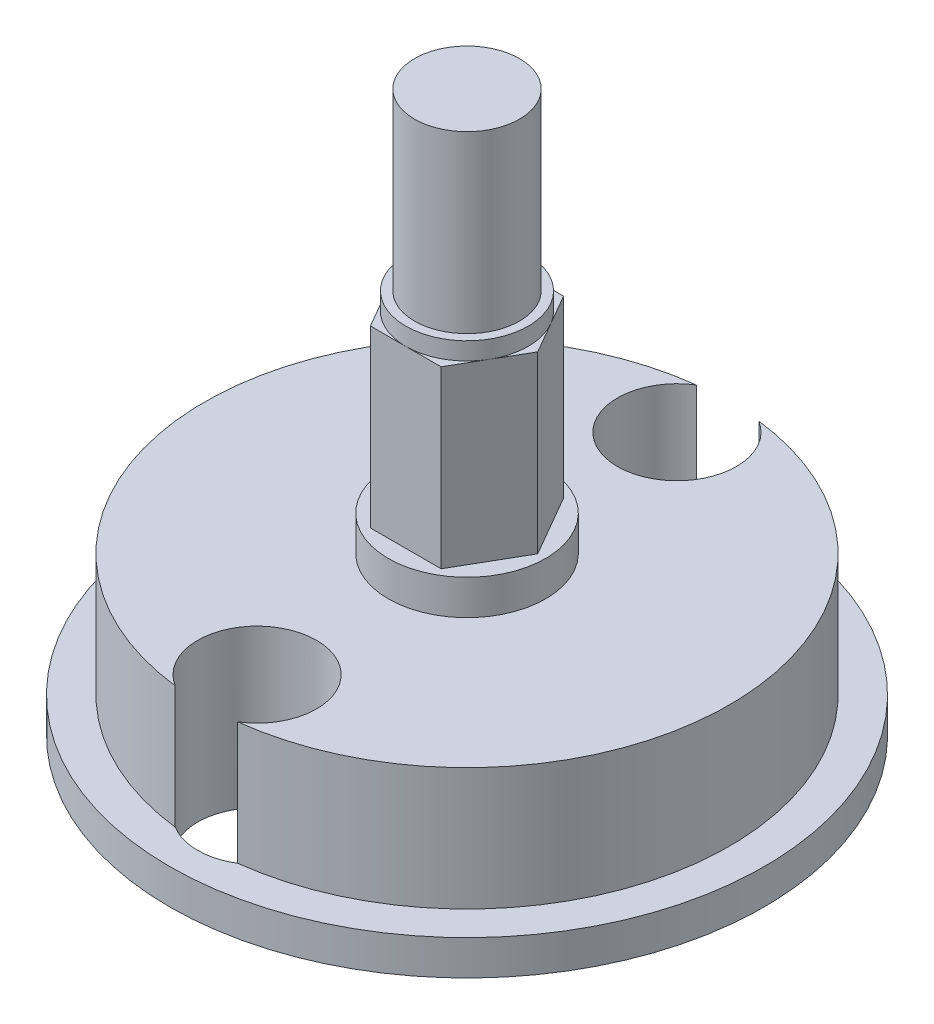
ISO-10303-21;
HEADER;
FILE_DESCRIPTION(('STEP AP214'),'2;1');
FILE_NAME('part.step','',(''),(''),'','','');
FILE_SCHEMA(('AUTOMOTIVE_DESIGN { 1 0 10303 214 1 1 1 1 }'));
ENDSEC;
DATA;
#1=APPLICATION_CONTEXT('core data for automotive mechanical design processes');
#2=APPLICATION_PROTOCOL_DEFINITION('international standard','automotive_design',2000,#1);
#3=PRODUCT_CONTEXT('',#1,'mechanical');
#4=PRODUCT('Part','Part','',(#3));
#5=PRODUCT_RELATED_PRODUCT_CATEGORY('part','',(#4));
#6=PRODUCT_DEFINITION_FORMATION('','',#4);
#7=PRODUCT_DEFINITION_CONTEXT('part definition',#1,'design');
#8=PRODUCT_DEFINITION('design','',#6,#7);
#9=PRODUCT_DEFINITION_SHAPE('','',#8);
#10=(LENGTH_UNIT() NAMED_UNIT(*) SI_UNIT(.MILLI.,.METRE.));
#11=(NAMED_UNIT(*) PLANE_ANGLE_UNIT() SI_UNIT($,.RADIAN.));
#12=(NAMED_UNIT(*) SI_UNIT($,.STERADIAN.) SOLID_ANGLE_UNIT());
#13=UNCERTAINTY_MEASURE_WITH_UNIT(LENGTH_MEASURE(1.E-05),#10,'distance_accuracy_value','');
#14=(GEOMETRIC_REPRESENTATION_CONTEXT(3) GLOBAL_UNCERTAINTY_ASSIGNED_CONTEXT((#13)) GLOBAL_UNIT_ASSIGNED_CONTEXT((#10,
#11,#12)) REPRESENTATION_CONTEXT('',''));
#15=CARTESIAN_POINT('',(0.,0.,0.));
#16=DIRECTION('',(0.,0.,1.));
#17=DIRECTION('',(1.,0.,0.));
#18=AXIS2_PLACEMENT_3D('',#15,#16,#17);
#19=CARTESIAN_POINT('',(0.,4.5,0.));
#20=DIRECTION('',(0.,-1.,0.));
#21=DIRECTION('',(0.,0.,-1.));
#22=AXIS2_PLACEMENT_3D('',#19,#20,#21);
#23=CYLINDRICAL_SURFACE('',#22,7.5);
#24=CARTESIAN_POINT('',(0.,1.,0.));
#25=DIRECTION('',(0.,1.,0.));
#26=DIRECTION('',(0.,0.,1.));
#27=AXIS2_PLACEMENT_3D('',#24,#25,#26);
#28=CIRCLE('',#27,7.5);
#29=CARTESIAN_POINT('',(0.892835682281763,0.999999999999999,-7.44666666666667));
#30=VERTEX_POINT('',#29);
#31=CARTESIAN_POINT('',(0.892835682281763,0.999999999999999,7.44666666666667));
#32=VERTEX_POINT('',#31);
#33=EDGE_CURVE('E141',#30,#32,#28,.F.);
#34=ORIENTED_EDGE('',*,*,#33,.F.);
#35=DIRECTION('',(0.,1.,0.));
#36=VECTOR('',#35,1.);
#37=CARTESIAN_POINT('',(0.892835682281764,2.25,-7.44666666666667));
#38=LINE('',#37,#36);
#39=CARTESIAN_POINT('',(0.892835682281764,4.5,-7.44666666666667));
#40=VERTEX_POINT('',#39);
#41=EDGE_CURVE('E132',#30,#40,#38,.T.);
#42=ORIENTED_EDGE('',*,*,#41,.T.);
#43=CARTESIAN_POINT('',(0.,4.5,0.));
#44=DIRECTION('',(0.,1.,0.));
#45=DIRECTION('',(0.,0.,1.));
#46=AXIS2_PLACEMENT_3D('',#43,#44,#45);
#47=CIRCLE('',#46,7.5);
#48=CARTESIAN_POINT('',(0.892835682281763,4.5,7.44666666666667));
#49=VERTEX_POINT('',#48);
#50=EDGE_CURVE('E140',#49,#40,#47,.T.);
#51=ORIENTED_EDGE('',*,*,#50,.F.);
#52=DIRECTION('',(0.,1.,0.));
#53=VECTOR('',#52,1.);
#54=CARTESIAN_POINT('',(0.892835682281764,2.25,7.44666666666667));
#55=LINE('',#54,#53);
#56=EDGE_CURVE('E59',#49,#32,#55,.F.);
#57=ORIENTED_EDGE('',*,*,#56,.T.);
#58=EDGE_LOOP('',(#34,#42,#51,#57));
#59=FACE_BOUND('',#58,.T.);
#60=ADVANCED_FACE('F37',(#59),#23,.T.);
#61=CARTESIAN_POINT('',(0.,10.5,0.));
#62=DIRECTION('',(0.,1.,0.));
#63=DIRECTION('',(0.,0.,1.));
#64=AXIS2_PLACEMENT_3D('',#61,#62,#63);
#65=PLANE('',#64);
#66=CARTESIAN_POINT('',(0.,10.5,0.));
#67=DIRECTION('',(0.,1.,0.));
#68=DIRECTION('',(0.,0.,1.));
#69=AXIS2_PLACEMENT_3D('',#66,#67,#68);
#70=CIRCLE('',#69,1.75);
#71=CARTESIAN_POINT('',(0.,10.5,1.75));
#72=VERTEX_POINT('',#71);
#73=CARTESIAN_POINT('',(1.51554445662277,10.5,0.874999999999999));
#74=VERTEX_POINT('',#73);
#75=EDGE_CURVE('E215',#72,#74,#70,.T.);
#76=ORIENTED_EDGE('',*,*,#75,.F.);
#77=DIRECTION('',(1.,0.,0.));
#78=VECTOR('',#77,1.);
#79=CARTESIAN_POINT('',(-1.01036297108184,10.5,1.75));
#80=LINE('',#79,#78);
#81=CARTESIAN_POINT('',(1.01036297108185,10.5,1.75));
#82=VERTEX_POINT('',#81);
#83=EDGE_CURVE('E195',#72,#82,#80,.T.);
#84=ORIENTED_EDGE('',*,*,#83,.T.);
#85=DIRECTION('',(0.5,0.,-0.866025403784439));
#86=VECTOR('',#85,1.);
#87=CARTESIAN_POINT('',(1.01036297108185,10.5,1.75));
#88=LINE('',#87,#86);
#89=EDGE_CURVE('E212',#82,#74,#88,.T.);
#90=ORIENTED_EDGE('',*,*,#89,.T.);
#91=EDGE_LOOP('',(#76,#84,#90));
#92=FACE_BOUND('',#91,.T.);
#93=ADVANCED_FACE('F264',(#92),#65,.T.);
#94=CARTESIAN_POINT('',(1.51554445662277,10.5,-0.875000000000001));
#95=VERTEX_POINT('',#94);
#96=EDGE_CURVE('E219',#74,#95,#70,.T.);
#97=ORIENTED_EDGE('',*,*,#96,.F.);
#98=CARTESIAN_POINT('',(2.02072594216369,10.5,0.));
#99=VERTEX_POINT('',#98);
#100=EDGE_CURVE('E177',#74,#99,#88,.T.);
#101=ORIENTED_EDGE('',*,*,#100,.T.);
#102=DIRECTION('',(-0.5,0.,-0.866025403784438));
#103=VECTOR('',#102,1.);
#104=CARTESIAN_POINT('',(2.02072594216369,10.5,0.));
#105=LINE('',#104,#103);
#106=EDGE_CURVE('E208',#99,#95,#105,.T.);
#107=ORIENTED_EDGE('',*,*,#106,.T.);
#108=EDGE_LOOP('',(#97,#101,#107));
#109=FACE_BOUND('',#108,.T.);
#110=ADVANCED_FACE('F268',(#109),#65,.T.);
#111=CARTESIAN_POINT('',(0.,10.5,-1.75));
#112=VERTEX_POINT('',#111);
#113=EDGE_CURVE('E515',#95,#112,#70,.T.);
#114=ORIENTED_EDGE('',*,*,#113,.F.);
#115=CARTESIAN_POINT('',(1.01036297108184,10.5,-1.75));
#116=VERTEX_POINT('',#115);
#117=EDGE_CURVE('E211',#95,#116,#105,.T.);
#118=ORIENTED_EDGE('',*,*,#117,.T.);
#119=DIRECTION('',(-1.,0.,0.));
#120=VECTOR('',#119,1.);
#121=CARTESIAN_POINT('',(1.01036297108184,10.5,-1.75));
#122=LINE('',#121,#120);
#123=EDGE_CURVE('E204',#116,#112,#122,.T.);
#124=ORIENTED_EDGE('',*,*,#123,.T.);
#125=EDGE_LOOP('',(#114,#118,#124));
#126=FACE_BOUND('',#125,.T.);
#127=ADVANCED_FACE('F418',(#126),#65,.T.);
#128=CARTESIAN_POINT('',(-1.51554445662277,10.5,-0.874999999999999));
#129=VERTEX_POINT('',#128);
#130=EDGE_CURVE('E508',#112,#129,#70,.T.);
#131=ORIENTED_EDGE('',*,*,#130,.F.);
#132=CARTESIAN_POINT('',(-1.01036297108185,10.5,-1.75));
#133=VERTEX_POINT('',#132);
#134=EDGE_CURVE('E207',#112,#133,#122,.T.);
#135=ORIENTED_EDGE('',*,*,#134,.T.);
#136=DIRECTION('',(-0.5,0.,0.866025403784439));
#137=VECTOR('',#136,1.);
#138=CARTESIAN_POINT('',(-1.01036297108185,10.5,-1.75));
#139=LINE('',#138,#137);
#140=EDGE_CURVE('E200',#133,#129,#139,.T.);
#141=ORIENTED_EDGE('',*,*,#140,.T.);
#142=EDGE_LOOP('',(#131,#135,#141));
#143=FACE_BOUND('',#142,.T.);
#144=ADVANCED_FACE('F281',(#143),#65,.T.);
#145=CARTESIAN_POINT('',(-1.51554445662277,10.5,0.875));
#146=VERTEX_POINT('',#145);
#147=EDGE_CURVE('E516',#129,#146,#70,.T.);
#148=ORIENTED_EDGE('',*,*,#147,.F.);
#149=CARTESIAN_POINT('',(-2.02072594216369,10.5,0.));
#150=VERTEX_POINT('',#149);
#151=EDGE_CURVE('E203',#129,#150,#139,.T.);
#152=ORIENTED_EDGE('',*,*,#151,.T.);
#153=DIRECTION('',(0.5,0.,0.866025403784438));
#154=VECTOR('',#153,1.);
#155=CARTESIAN_POINT('',(-2.02072594216369,10.5,0.));
#156=LINE('',#155,#154);
#157=EDGE_CURVE('E196',#150,#146,#156,.T.);
#158=ORIENTED_EDGE('',*,*,#157,.T.);
#159=EDGE_LOOP('',(#148,#152,#158));
#160=FACE_BOUND('',#159,.T.);
#161=ADVANCED_FACE('F273',(#160),#65,.T.);
#162=CARTESIAN_POINT('',(-0.892835682281766,4.5,-7.44666666666667));
#163=VERTEX_POINT('',#162);
#164=CARTESIAN_POINT('',(-0.892835682281767,4.5,7.44666666666667));
#165=VERTEX_POINT('',#164);
#166=EDGE_CURVE('E147',#163,#165,#47,.T.);
#167=ORIENTED_EDGE('',*,*,#166,.F.);
#168=DIRECTION('',(0.,1.,0.));
#169=VECTOR('',#168,1.);
#170=CARTESIAN_POINT('',(-0.892835682281767,2.25,-7.44666666666667));
#171=LINE('',#170,#169);
#172=CARTESIAN_POINT('',(-0.892835682281766,0.999999999999999,-7.44666666666667));
#173=VERTEX_POINT('',#172);
#174=EDGE_CURVE('E51',#163,#173,#171,.F.);
#175=ORIENTED_EDGE('',*,*,#174,.T.);
#176=CARTESIAN_POINT('',(-0.892835682281766,0.999999999999999,7.44666666666667));
#177=VERTEX_POINT('',#176);
#178=EDGE_CURVE('E226',#177,#173,#28,.F.);
#179=ORIENTED_EDGE('',*,*,#178,.F.);
#180=DIRECTION('',(0.,1.,0.));
#181=VECTOR('',#180,1.);
#182=CARTESIAN_POINT('',(-0.892835682281767,2.25,7.44666666666667));
#183=LINE('',#182,#181);
#184=EDGE_CURVE('E231',#177,#165,#183,.T.);
#185=ORIENTED_EDGE('',*,*,#184,.T.);
#186=EDGE_LOOP('',(#167,#175,#179,#185));
#187=FACE_BOUND('',#186,.T.);
#188=ADVANCED_FACE('F39',(#187),#23,.T.);
#189=CARTESIAN_POINT('',(0.,4.5,0.));
#190=DIRECTION('',(0.,1.,0.));
#191=DIRECTION('',(0.,0.,1.));
#192=AXIS2_PLACEMENT_3D('',#189,#190,#191);
#193=PLANE('',#192);
#194=CARTESIAN_POINT('',(0.,4.5,-6.));
#195=DIRECTION('',(0.,1.,0.));
#196=DIRECTION('',(0.,0.,1.));
#197=AXIS2_PLACEMENT_3D('',#194,#195,#196);
#198=CIRCLE('',#197,1.7);
#199=EDGE_CURVE('E12',#163,#40,#198,.T.);
#200=ORIENTED_EDGE('',*,*,#199,.F.);
#201=ORIENTED_EDGE('',*,*,#166,.T.);
#202=CARTESIAN_POINT('',(0.,4.5,6.));
#203=DIRECTION('',(0.,1.,0.));
#204=DIRECTION('',(0.,0.,1.));
#205=AXIS2_PLACEMENT_3D('',#202,#203,#204);
#206=CIRCLE('',#205,1.7);
#207=EDGE_CURVE('E142',#49,#165,#206,.T.);
#208=ORIENTED_EDGE('',*,*,#207,.F.);
#209=ORIENTED_EDGE('',*,*,#50,.T.);
#210=EDGE_LOOP('',(#200,#201,#208,#209));
#211=FACE_BOUND('',#210,.T.);
#212=CARTESIAN_POINT('',(0.,4.5,0.));
#213=DIRECTION('',(0.,1.,0.));
#214=DIRECTION('',(0.,0.,1.));
#215=AXIS2_PLACEMENT_3D('',#212,#213,#214);
#216=CIRCLE('',#215,2.25);
#217=CARTESIAN_POINT('',(0.,4.5,2.25));
#218=VERTEX_POINT('',#217);
#219=EDGE_CURVE('E146',#218,#218,#216,.T.);
#220=ORIENTED_EDGE('',*,*,#219,.F.);
#221=EDGE_LOOP('',(#220));
#222=FACE_BOUND('',#221,.T.);
#223=ADVANCED_FACE('F144',(#211,#222),#193,.T.);
#224=CARTESIAN_POINT('',(0.,5.5,0.));
#225=DIRECTION('',(0.,-1.,0.));
#226=DIRECTION('',(0.,0.,-1.));
#227=AXIS2_PLACEMENT_3D('',#224,#225,#226);
#228=CYLINDRICAL_SURFACE('',#227,2.25);
#229=CARTESIAN_POINT('',(0.,5.5,0.));
#230=DIRECTION('',(0.,1.,0.));
#231=DIRECTION('',(0.,0.,1.));
#232=AXIS2_PLACEMENT_3D('',#229,#230,#231);
#233=CIRCLE('',#232,2.25);
#234=CARTESIAN_POINT('',(0.,5.5,2.25));
#235=VERTEX_POINT('',#234);
#236=EDGE_CURVE('E151',#235,#235,#233,.T.);
#237=ORIENTED_EDGE('',*,*,#236,.F.);
#238=EDGE_LOOP('',(#237));
#239=FACE_BOUND('',#238,.T.);
#240=ORIENTED_EDGE('',*,*,#219,.T.);
#241=EDGE_LOOP('',(#240));
#242=FACE_BOUND('',#241,.T.);
#243=ADVANCED_FACE('F279',(#239,#242),#228,.T.);
#244=CARTESIAN_POINT('',(0.,5.5,0.));
#245=DIRECTION('',(0.,1.,0.));
#246=DIRECTION('',(0.,0.,1.));
#247=AXIS2_PLACEMENT_3D('',#244,#245,#246);
#248=PLANE('',#247);
#249=DIRECTION('',(0.5,0.,-0.866025403784439));
#250=VECTOR('',#249,1.);
#251=CARTESIAN_POINT('',(1.01036297108185,5.5,1.75));
#252=LINE('',#251,#250);
#253=CARTESIAN_POINT('',(1.01036297108185,5.5,1.75));
#254=VERTEX_POINT('',#253);
#255=CARTESIAN_POINT('',(2.02072594216369,5.5,0.));
#256=VERTEX_POINT('',#255);
#257=EDGE_CURVE('E190',#254,#256,#252,.T.);
#258=ORIENTED_EDGE('',*,*,#257,.F.);
#259=DIRECTION('',(1.,0.,0.));
#260=VECTOR('',#259,1.);
#261=CARTESIAN_POINT('',(-1.01036297108184,5.5,1.75));
#262=LINE('',#261,#260);
#263=CARTESIAN_POINT('',(-1.01036297108184,5.5,1.75));
#264=VERTEX_POINT('',#263);
#265=EDGE_CURVE('E174',#264,#254,#262,.T.);
#266=ORIENTED_EDGE('',*,*,#265,.F.);
#267=DIRECTION('',(0.5,0.,0.866025403784438));
#268=VECTOR('',#267,1.);
#269=CARTESIAN_POINT('',(-2.02072594216369,5.5,0.));
#270=LINE('',#269,#268);
#271=CARTESIAN_POINT('',(-2.02072594216369,5.5,0.));
#272=VERTEX_POINT('',#271);
#273=EDGE_CURVE('E178',#272,#264,#270,.T.);
#274=ORIENTED_EDGE('',*,*,#273,.F.);
#275=DIRECTION('',(-0.5,0.,0.866025403784439));
#276=VECTOR('',#275,1.);
#277=CARTESIAN_POINT('',(-1.01036297108185,5.5,-1.75));
#278=LINE('',#277,#276);
#279=CARTESIAN_POINT('',(-1.01036297108185,5.5,-1.75));
#280=VERTEX_POINT('',#279);
#281=EDGE_CURVE('E181',#280,#272,#278,.T.);
#282=ORIENTED_EDGE('',*,*,#281,.F.);
#283=DIRECTION('',(-1.,0.,0.));
#284=VECTOR('',#283,1.);
#285=CARTESIAN_POINT('',(1.01036297108184,5.5,-1.75));
#286=LINE('',#285,#284);
#287=CARTESIAN_POINT('',(1.01036297108184,5.5,-1.75));
#288=VERTEX_POINT('',#287);
#289=EDGE_CURVE('E184',#288,#280,#286,.T.);
#290=ORIENTED_EDGE('',*,*,#289,.F.);
#291=DIRECTION('',(-0.5,0.,-0.866025403784438));
#292=VECTOR('',#291,1.);
#293=CARTESIAN_POINT('',(2.02072594216369,5.5,0.));
#294=LINE('',#293,#292);
#295=EDGE_CURVE('E187',#256,#288,#294,.T.);
#296=ORIENTED_EDGE('',*,*,#295,.F.);
#297=EDGE_LOOP('',(#258,#266,#274,#282,#290,#296));
#298=FACE_BOUND('',#297,.T.);
#299=ORIENTED_EDGE('',*,*,#236,.T.);
#300=EDGE_LOOP('',(#299));
#301=FACE_BOUND('',#300,.T.);
#302=ADVANCED_FACE('F341',(#298,#301),#248,.T.);
#303=CARTESIAN_POINT('',(1.01036297108185,10.5,1.75));
#304=DIRECTION('',(-0.866025403784439,0.,-0.5));
#305=DIRECTION('',(-0.5,0.,0.866025403784439));
#306=AXIS2_PLACEMENT_3D('',#303,#304,#305);
#307=PLANE('',#306);
#308=ORIENTED_EDGE('',*,*,#257,.T.);
#309=DIRECTION('',(0.,-1.,0.));
#310=VECTOR('',#309,1.);
#311=CARTESIAN_POINT('',(2.02072594216369,10.5,0.));
#312=LINE('',#311,#310);
#313=EDGE_CURVE('E155',#99,#256,#312,.T.);
#314=ORIENTED_EDGE('',*,*,#313,.F.);
#315=ORIENTED_EDGE('',*,*,#100,.F.);
#316=ORIENTED_EDGE('',*,*,#89,.F.);
#317=DIRECTION('',(0.,-1.,0.));
#318=VECTOR('',#317,1.);
#319=CARTESIAN_POINT('',(1.01036297108185,10.5,1.75));
#320=LINE('',#319,#318);
#321=EDGE_CURVE('E170',#82,#254,#320,.T.);
#322=ORIENTED_EDGE('',*,*,#321,.T.);
#323=EDGE_LOOP('',(#308,#314,#315,#316,#322));
#324=FACE_BOUND('',#323,.T.);
#325=ADVANCED_FACE('F337',(#324),#307,.F.);
#326=CARTESIAN_POINT('',(2.02072594216369,10.5,0.));
#327=DIRECTION('',(-0.866025403784438,0.,0.5));
#328=DIRECTION('',(0.500000000000001,0.,0.866025403784438));
#329=AXIS2_PLACEMENT_3D('',#326,#327,#328);
#330=PLANE('',#329);
#331=ORIENTED_EDGE('',*,*,#295,.T.);
#332=DIRECTION('',(0.,-1.,0.));
#333=VECTOR('',#332,1.);
#334=CARTESIAN_POINT('',(1.01036297108184,10.5,-1.75));
#335=LINE('',#334,#333);
#336=EDGE_CURVE('E158',#116,#288,#335,.T.);
#337=ORIENTED_EDGE('',*,*,#336,.F.);
#338=ORIENTED_EDGE('',*,*,#117,.F.);
#339=ORIENTED_EDGE('',*,*,#106,.F.);
#340=ORIENTED_EDGE('',*,*,#313,.T.);
#341=EDGE_LOOP('',(#331,#337,#338,#339,#340));
#342=FACE_BOUND('',#341,.T.);
#343=ADVANCED_FACE('F333',(#342),#330,.F.);
#344=CARTESIAN_POINT('',(1.01036297108184,10.5,-1.75));
#345=DIRECTION('',(0.,0.,1.));
#346=DIRECTION('',(1.,0.,0.));
#347=AXIS2_PLACEMENT_3D('',#344,#345,#346);
#348=PLANE('',#347);
#349=ORIENTED_EDGE('',*,*,#289,.T.);
#350=DIRECTION('',(0.,-1.,0.));
#351=VECTOR('',#350,1.);
#352=CARTESIAN_POINT('',(-1.01036297108185,10.5,-1.75));
#353=LINE('',#352,#351);
#354=EDGE_CURVE('E161',#133,#280,#353,.T.);
#355=ORIENTED_EDGE('',*,*,#354,.F.);
#356=ORIENTED_EDGE('',*,*,#134,.F.);
#357=ORIENTED_EDGE('',*,*,#123,.F.);
#358=ORIENTED_EDGE('',*,*,#336,.T.);
#359=EDGE_LOOP('',(#349,#355,#356,#357,#358));
#360=FACE_BOUND('',#359,.T.);
#361=ADVANCED_FACE('F329',(#360),#348,.F.);
#362=CARTESIAN_POINT('',(-1.01036297108185,10.5,-1.75));
#363=DIRECTION('',(0.866025403784439,0.,0.5));
#364=DIRECTION('',(0.5,0.,-0.866025403784439));
#365=AXIS2_PLACEMENT_3D('',#362,#363,#364);
#366=PLANE('',#365);
#367=ORIENTED_EDGE('',*,*,#281,.T.);
#368=DIRECTION('',(0.,-1.,0.));
#369=VECTOR('',#368,1.);
#370=CARTESIAN_POINT('',(-2.02072594216369,10.5,0.));
#371=LINE('',#370,#369);
#372=EDGE_CURVE('E164',#150,#272,#371,.T.);
#373=ORIENTED_EDGE('',*,*,#372,.F.);
#374=ORIENTED_EDGE('',*,*,#151,.F.);
#375=ORIENTED_EDGE('',*,*,#140,.F.);
#376=ORIENTED_EDGE('',*,*,#354,.T.);
#377=EDGE_LOOP('',(#367,#373,#374,#375,#376));
#378=FACE_BOUND('',#377,.T.);
#379=ADVANCED_FACE('F325',(#378),#366,.F.);
#380=CARTESIAN_POINT('',(-2.02072594216369,10.5,0.));
#381=DIRECTION('',(0.866025403784439,0.,-0.5));
#382=DIRECTION('',(-0.5,0.,-0.866025403784439));
#383=AXIS2_PLACEMENT_3D('',#380,#381,#382);
#384=PLANE('',#383);
#385=ORIENTED_EDGE('',*,*,#273,.T.);
#386=DIRECTION('',(0.,-1.,0.));
#387=VECTOR('',#386,1.);
#388=CARTESIAN_POINT('',(-1.01036297108184,10.5,1.75));
#389=LINE('',#388,#387);
#390=CARTESIAN_POINT('',(-1.01036297108184,10.5,1.75));
#391=VERTEX_POINT('',#390);
#392=EDGE_CURVE('E167',#391,#264,#389,.T.);
#393=ORIENTED_EDGE('',*,*,#392,.F.);
#394=EDGE_CURVE('E199',#146,#391,#156,.T.);
#395=ORIENTED_EDGE('',*,*,#394,.F.);
#396=ORIENTED_EDGE('',*,*,#157,.F.);
#397=ORIENTED_EDGE('',*,*,#372,.T.);
#398=EDGE_LOOP('',(#385,#393,#395,#396,#397));
#399=FACE_BOUND('',#398,.T.);
#400=ADVANCED_FACE('F321',(#399),#384,.F.);
#401=CARTESIAN_POINT('',(-1.01036297108184,10.5,1.75));
#402=DIRECTION('',(0.,0.,-1.));
#403=DIRECTION('',(-1.,0.,0.));
#404=AXIS2_PLACEMENT_3D('',#401,#402,#403);
#405=PLANE('',#404);
#406=ORIENTED_EDGE('',*,*,#265,.T.);
#407=ORIENTED_EDGE('',*,*,#321,.F.);
#408=ORIENTED_EDGE('',*,*,#83,.F.);
#409=EDGE_CURVE('E173',#391,#72,#80,.T.);
#410=ORIENTED_EDGE('',*,*,#409,.F.);
#411=ORIENTED_EDGE('',*,*,#392,.T.);
#412=EDGE_LOOP('',(#406,#407,#408,#410,#411));
#413=FACE_BOUND('',#412,.T.);
#414=ADVANCED_FACE('F317',(#413),#405,.F.);
#415=EDGE_CURVE('E149',#146,#72,#70,.T.);
#416=ORIENTED_EDGE('',*,*,#415,.F.);
#417=ORIENTED_EDGE('',*,*,#394,.T.);
#418=ORIENTED_EDGE('',*,*,#409,.T.);
#419=EDGE_LOOP('',(#416,#417,#418));
#420=FACE_BOUND('',#419,.T.);
#421=ADVANCED_FACE('F271',(#420),#65,.T.);
#422=CARTESIAN_POINT('',(0.,11.,0.));
#423=DIRECTION('',(0.,-1.,0.));
#424=DIRECTION('',(0.,0.,-1.));
#425=AXIS2_PLACEMENT_3D('',#422,#423,#424);
#426=CYLINDRICAL_SURFACE('',#425,1.75);
#427=CARTESIAN_POINT('',(0.,11.,0.));
#428=DIRECTION('',(0.,1.,0.));
#429=DIRECTION('',(0.,0.,1.));
#430=AXIS2_PLACEMENT_3D('',#427,#428,#429);
#431=CIRCLE('',#430,1.75);
#432=CARTESIAN_POINT('',(0.,11.,1.75));
#433=VERTEX_POINT('',#432);
#434=EDGE_CURVE('E193',#433,#433,#431,.T.);
#435=ORIENTED_EDGE('',*,*,#434,.F.);
#436=EDGE_LOOP('',(#435));
#437=FACE_BOUND('',#436,.T.);
#438=ORIENTED_EDGE('',*,*,#75,.T.);
#439=ORIENTED_EDGE('',*,*,#96,.T.);
#440=ORIENTED_EDGE('',*,*,#113,.T.);
#441=ORIENTED_EDGE('',*,*,#130,.T.);
#442=ORIENTED_EDGE('',*,*,#147,.T.);
#443=ORIENTED_EDGE('',*,*,#415,.T.);
#444=EDGE_LOOP('',(#438,#439,#440,#441,#442,#443));
#445=FACE_BOUND('',#444,.T.);
#446=ADVANCED_FACE('F311',(#437,#445),#426,.T.);
#447=CARTESIAN_POINT('',(0.,11.,0.));
#448=DIRECTION('',(0.,1.,0.));
#449=DIRECTION('',(0.,0.,1.));
#450=AXIS2_PLACEMENT_3D('',#447,#448,#449);
#451=PLANE('',#450);
#452=CARTESIAN_POINT('',(0.,11.,0.));
#453=DIRECTION('',(0.,1.,0.));
#454=DIRECTION('',(0.,0.,1.));
#455=AXIS2_PLACEMENT_3D('',#452,#453,#454);
#456=CIRCLE('',#455,1.5);
#457=CARTESIAN_POINT('',(0.,11.,1.5));
#458=VERTEX_POINT('',#457);
#459=EDGE_CURVE('E45',#458,#458,#456,.T.);
#460=ORIENTED_EDGE('',*,*,#459,.F.);
#461=EDGE_LOOP('',(#460));
#462=FACE_BOUND('',#461,.T.);
#463=ORIENTED_EDGE('',*,*,#434,.T.);
#464=EDGE_LOOP('',(#463));
#465=FACE_BOUND('',#464,.T.);
#466=ADVANCED_FACE('F307',(#462,#465),#451,.T.);
#467=CARTESIAN_POINT('',(0.,16.,0.));
#468=DIRECTION('',(0.,-1.,0.));
#469=DIRECTION('',(0.,0.,-1.));
#470=AXIS2_PLACEMENT_3D('',#467,#468,#469);
#471=CYLINDRICAL_SURFACE('',#470,1.5);
#472=CARTESIAN_POINT('',(0.,16.,0.));
#473=DIRECTION('',(0.,1.,0.));
#474=DIRECTION('',(0.,0.,1.));
#475=AXIS2_PLACEMENT_3D('',#472,#473,#474);
#476=CIRCLE('',#475,1.5);
#477=CARTESIAN_POINT('',(0.,16.,1.5));
#478=VERTEX_POINT('',#477);
#479=EDGE_CURVE('E218',#478,#478,#476,.T.);
#480=ORIENTED_EDGE('',*,*,#479,.F.);
#481=EDGE_LOOP('',(#480));
#482=FACE_BOUND('',#481,.T.);
#483=ORIENTED_EDGE('',*,*,#459,.T.);
#484=EDGE_LOOP('',(#483));
#485=FACE_BOUND('',#484,.T.);
#486=ADVANCED_FACE('F300',(#482,#485),#471,.T.);
#487=CARTESIAN_POINT('',(0.,16.,0.));
#488=DIRECTION('',(0.,1.,0.));
#489=DIRECTION('',(0.,0.,1.));
#490=AXIS2_PLACEMENT_3D('',#487,#488,#489);
#491=PLANE('',#490);
#492=ORIENTED_EDGE('',*,*,#479,.T.);
#493=EDGE_LOOP('',(#492));
#494=FACE_BOUND('',#493,.T.);
#495=ADVANCED_FACE('F294',(#494),#491,.T.);
#496=CARTESIAN_POINT('',(0.,28.5416305603426,0.));
#497=DIRECTION('',(0.,-1.,0.));
#498=DIRECTION('',(0.,0.,-1.));
#499=AXIS2_PLACEMENT_3D('',#496,#497,#498);
#500=CYLINDRICAL_SURFACE('',#499,8.5);
#501=CARTESIAN_POINT('',(0.,0.,0.));
#502=DIRECTION('',(0.,-1.,0.));
#503=DIRECTION('',(0.,0.,-1.));
#504=AXIS2_PLACEMENT_3D('',#501,#502,#503);
#505=CIRCLE('',#504,8.5);
#506=CARTESIAN_POINT('',(0.,0.,-8.5));
#507=VERTEX_POINT('',#506);
#508=EDGE_CURVE('E230',#507,#507,#505,.T.);
#509=ORIENTED_EDGE('',*,*,#508,.F.);
#510=EDGE_LOOP('',(#509));
#511=FACE_BOUND('',#510,.T.);
#512=CARTESIAN_POINT('',(0.,1.,0.));
#513=DIRECTION('',(0.,1.,0.));
#514=DIRECTION('',(0.,0.,1.));
#515=AXIS2_PLACEMENT_3D('',#512,#513,#514);
#516=CIRCLE('',#515,8.5);
#517=CARTESIAN_POINT('',(0.,1.,8.5));
#518=VERTEX_POINT('',#517);
#519=EDGE_CURVE('E227',#518,#518,#516,.F.);
#520=ORIENTED_EDGE('',*,*,#519,.T.);
#521=EDGE_LOOP('',(#520));
#522=FACE_BOUND('',#521,.T.);
#523=ADVANCED_FACE('F289',(#511,#522),#500,.T.);
#524=CARTESIAN_POINT('',(0.,1.,0.));
#525=DIRECTION('',(0.,1.,0.));
#526=DIRECTION('',(0.,0.,1.));
#527=AXIS2_PLACEMENT_3D('',#524,#525,#526);
#528=PLANE('',#527);
#529=CARTESIAN_POINT('',(0.,1.,-6.));
#530=DIRECTION('',(0.,1.,0.));
#531=DIRECTION('',(0.,0.,1.));
#532=AXIS2_PLACEMENT_3D('',#529,#530,#531);
#533=CIRCLE('',#532,1.7);
#534=EDGE_CURVE('E246',#30,#173,#533,.T.);
#535=ORIENTED_EDGE('',*,*,#534,.F.);
#536=ORIENTED_EDGE('',*,*,#33,.T.);
#537=CARTESIAN_POINT('',(0.,1.,6.));
#538=DIRECTION('',(0.,1.,0.));
#539=DIRECTION('',(0.,0.,1.));
#540=AXIS2_PLACEMENT_3D('',#537,#538,#539);
#541=CIRCLE('',#540,1.7);
#542=EDGE_CURVE('E239',#177,#32,#541,.T.);
#543=ORIENTED_EDGE('',*,*,#542,.F.);
#544=ORIENTED_EDGE('',*,*,#178,.T.);
#545=EDGE_LOOP('',(#535,#536,#543,#544));
#546=FACE_BOUND('',#545,.T.);
#547=ORIENTED_EDGE('',*,*,#519,.F.);
#548=EDGE_LOOP('',(#547));
#549=FACE_BOUND('',#548,.T.);
#550=ADVANCED_FACE('F286',(#546,#549),#528,.T.);
#551=CARTESIAN_POINT('',(0.,0.,0.));
#552=DIRECTION('',(0.,1.,0.));
#553=DIRECTION('',(0.,0.,1.));
#554=AXIS2_PLACEMENT_3D('',#551,#552,#553);
#555=PLANE('',#554);
#556=CARTESIAN_POINT('',(0.,0.,-6.));
#557=DIRECTION('',(0.,1.,0.));
#558=DIRECTION('',(0.,0.,1.));
#559=AXIS2_PLACEMENT_3D('',#556,#557,#558);
#560=CIRCLE('',#559,1.7);
#561=CARTESIAN_POINT('',(0.,0.,-4.3));
#562=VERTEX_POINT('',#561);
#563=EDGE_CURVE('E248',#562,#562,#560,.T.);
#564=ORIENTED_EDGE('',*,*,#563,.T.);
#565=EDGE_LOOP('',(#564));
#566=FACE_BOUND('',#565,.T.);
#567=CARTESIAN_POINT('',(0.,0.,6.));
#568=DIRECTION('',(0.,1.,0.));
#569=DIRECTION('',(0.,0.,1.));
#570=AXIS2_PLACEMENT_3D('',#567,#568,#569);
#571=CIRCLE('',#570,1.7);
#572=CARTESIAN_POINT('',(0.,0.,7.7));
#573=VERTEX_POINT('',#572);
#574=EDGE_CURVE('E241',#573,#573,#571,.T.);
#575=ORIENTED_EDGE('',*,*,#574,.T.);
#576=EDGE_LOOP('',(#575));
#577=FACE_BOUND('',#576,.T.);
#578=ORIENTED_EDGE('',*,*,#508,.T.);
#579=EDGE_LOOP('',(#578));
#580=FACE_BOUND('',#579,.T.);
#581=ADVANCED_FACE('F252',(#566,#577,#580),#555,.F.);
#582=CARTESIAN_POINT('',(0.,4.5,6.));
#583=DIRECTION('',(0.,1.,0.));
#584=DIRECTION('',(0.,0.,1.));
#585=AXIS2_PLACEMENT_3D('',#582,#583,#584);
#586=CYLINDRICAL_SURFACE('',#585,1.7);
#587=ORIENTED_EDGE('',*,*,#574,.F.);
#588=EDGE_LOOP('',(#587));
#589=FACE_BOUND('',#588,.T.);
#590=ORIENTED_EDGE('',*,*,#542,.T.);
#591=ORIENTED_EDGE('',*,*,#56,.F.);
#592=ORIENTED_EDGE('',*,*,#207,.T.);
#593=ORIENTED_EDGE('',*,*,#184,.F.);
#594=EDGE_LOOP('',(#590,#591,#592,#593));
#595=FACE_BOUND('',#594,.T.);
#596=ADVANCED_FACE('F256',(#589,#595),#586,.F.);
#597=CARTESIAN_POINT('',(0.,4.5,-6.));
#598=DIRECTION('',(0.,1.,0.));
#599=DIRECTION('',(0.,0.,1.));
#600=AXIS2_PLACEMENT_3D('',#597,#598,#599);
#601=CYLINDRICAL_SURFACE('',#600,1.7);
#602=ORIENTED_EDGE('',*,*,#563,.F.);
#603=EDGE_LOOP('',(#602));
#604=FACE_BOUND('',#603,.T.);
#605=ORIENTED_EDGE('',*,*,#534,.T.);
#606=ORIENTED_EDGE('',*,*,#174,.F.);
#607=ORIENTED_EDGE('',*,*,#199,.T.);
#608=ORIENTED_EDGE('',*,*,#41,.F.);
#609=EDGE_LOOP('',(#605,#606,#607,#608));
#610=FACE_BOUND('',#609,.T.);
#611=ADVANCED_FACE('F131',(#604,#610),#601,.F.);
#612=CLOSED_SHELL('',(#60,#93,#110,#127,#144,#161,#188,#223,#243,#302,#325,#343,#361,#379,#400,
#414,#421,#446,#466,#486,#495,#523,#550,#581,#596,#611));
#613=MANIFOLD_SOLID_BREP('B2',#612);
#614=ADVANCED_BREP_SHAPE_REPRESENTATION('',(#18,#613),#14);
#615=SHAPE_DEFINITION_REPRESENTATION(#9,#614);
ENDSEC;
END-ISO-10303-21;
